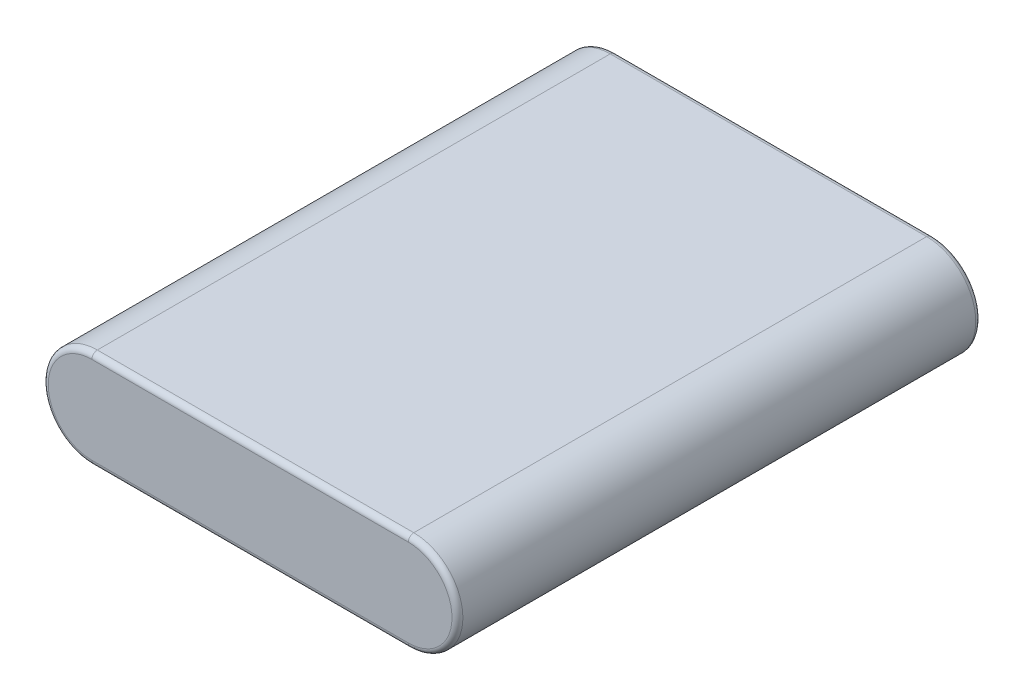
ISO-10303-21;
HEADER;
FILE_DESCRIPTION(('STEP AP214'),'2;1');
FILE_NAME('part.step','',(''),(''),'','','');
FILE_SCHEMA(('AUTOMOTIVE_DESIGN { 1 0 10303 214 1 1 1 1 }'));
ENDSEC;
DATA;
#1=APPLICATION_CONTEXT('core data for automotive mechanical design processes');
#2=APPLICATION_PROTOCOL_DEFINITION('international standard','automotive_design',2000,#1);
#3=PRODUCT_CONTEXT('',#1,'mechanical');
#4=PRODUCT('Part','Part','',(#3));
#5=PRODUCT_RELATED_PRODUCT_CATEGORY('part','',(#4));
#6=PRODUCT_DEFINITION_FORMATION('','',#4);
#7=PRODUCT_DEFINITION_CONTEXT('part definition',#1,'design');
#8=PRODUCT_DEFINITION('design','',#6,#7);
#9=PRODUCT_DEFINITION_SHAPE('','',#8);
#10=(LENGTH_UNIT() NAMED_UNIT(*) SI_UNIT(.MILLI.,.METRE.));
#11=(NAMED_UNIT(*) PLANE_ANGLE_UNIT() SI_UNIT($,.RADIAN.));
#12=(NAMED_UNIT(*) SI_UNIT($,.STERADIAN.) SOLID_ANGLE_UNIT());
#13=UNCERTAINTY_MEASURE_WITH_UNIT(LENGTH_MEASURE(1.E-05),#10,'distance_accuracy_value','');
#14=(GEOMETRIC_REPRESENTATION_CONTEXT(3) GLOBAL_UNCERTAINTY_ASSIGNED_CONTEXT((#13)) GLOBAL_UNIT_ASSIGNED_CONTEXT((#10,
#11,#12)) REPRESENTATION_CONTEXT('',''));
#15=CARTESIAN_POINT('',(0.,0.,0.));
#16=DIRECTION('',(0.,0.,1.));
#17=DIRECTION('',(1.,0.,0.));
#18=AXIS2_PLACEMENT_3D('',#15,#16,#17);
#19=CARTESIAN_POINT('',(0.,0.,96.));
#20=DIRECTION('',(0.,0.,-1.));
#21=DIRECTION('',(-1.,0.,0.));
#22=AXIS2_PLACEMENT_3D('',#19,#20,#21);
#23=CYLINDRICAL_SURFACE('',#22,8.99999999999999);
#24=DIRECTION('',(0.,0.,-1.));
#25=VECTOR('',#24,1.);
#26=CARTESIAN_POINT('',(0.,8.99999999999999,96.));
#27=LINE('',#26,#25);
#28=CARTESIAN_POINT('',(0.,8.99999999999999,95.));
#29=VERTEX_POINT('',#28);
#30=CARTESIAN_POINT('',(0.,8.99999999999999,1.));
#31=VERTEX_POINT('',#30);
#32=EDGE_CURVE('E104',#29,#31,#27,.T.);
#33=ORIENTED_EDGE('',*,*,#32,.T.);
#34=CARTESIAN_POINT('',(0.,0.,1.));
#35=DIRECTION('',(0.,0.,1.));
#36=DIRECTION('',(1.,0.,0.));
#37=AXIS2_PLACEMENT_3D('',#34,#35,#36);
#38=CIRCLE('',#37,8.99999999999999);
#39=CARTESIAN_POINT('',(0.,-8.99999999999999,1.));
#40=VERTEX_POINT('',#39);
#41=EDGE_CURVE('E183',#31,#40,#38,.T.);
#42=ORIENTED_EDGE('',*,*,#41,.T.);
#43=DIRECTION('',(0.,0.,-1.));
#44=VECTOR('',#43,1.);
#45=CARTESIAN_POINT('',(0.,-8.99999999999999,96.));
#46=LINE('',#45,#44);
#47=CARTESIAN_POINT('',(0.,-8.99999999999999,95.));
#48=VERTEX_POINT('',#47);
#49=EDGE_CURVE('E130',#48,#40,#46,.T.);
#50=ORIENTED_EDGE('',*,*,#49,.F.);
#51=CARTESIAN_POINT('',(0.,0.,95.));
#52=DIRECTION('',(0.,0.,1.));
#53=DIRECTION('',(1.,0.,0.));
#54=AXIS2_PLACEMENT_3D('',#51,#52,#53);
#55=CIRCLE('',#54,8.99999999999999);
#56=EDGE_CURVE('E181',#48,#29,#55,.F.);
#57=ORIENTED_EDGE('',*,*,#56,.T.);
#58=EDGE_LOOP('',(#33,#42,#50,#57));
#59=FACE_BOUND('',#58,.T.);
#60=ADVANCED_FACE('F33',(#59),#23,.T.);
#61=CARTESIAN_POINT('',(0.,-8.99999999999999,96.));
#62=DIRECTION('',(0.,1.,0.));
#63=DIRECTION('',(-1.,0.,0.));
#64=AXIS2_PLACEMENT_3D('',#61,#62,#63);
#65=PLANE('',#64);
#66=ORIENTED_EDGE('',*,*,#49,.T.);
#67=DIRECTION('',(1.,0.,0.));
#68=VECTOR('',#67,1.);
#69=CARTESIAN_POINT('',(0.,-8.99999999999999,1.));
#70=LINE('',#69,#68);
#71=CARTESIAN_POINT('',(58.,-9.,1.));
#72=VERTEX_POINT('',#71);
#73=EDGE_CURVE('E179',#40,#72,#70,.T.);
#74=ORIENTED_EDGE('',*,*,#73,.T.);
#75=DIRECTION('',(0.,0.,-1.));
#76=VECTOR('',#75,1.);
#77=CARTESIAN_POINT('',(58.,-9.,96.));
#78=LINE('',#77,#76);
#79=CARTESIAN_POINT('',(58.,-9.,95.));
#80=VERTEX_POINT('',#79);
#81=EDGE_CURVE('E121',#80,#72,#78,.T.);
#82=ORIENTED_EDGE('',*,*,#81,.F.);
#83=DIRECTION('',(1.,0.,0.));
#84=VECTOR('',#83,1.);
#85=CARTESIAN_POINT('',(0.,-8.99999999999999,95.));
#86=LINE('',#85,#84);
#87=EDGE_CURVE('E177',#80,#48,#86,.F.);
#88=ORIENTED_EDGE('',*,*,#87,.T.);
#89=EDGE_LOOP('',(#66,#74,#82,#88));
#90=FACE_BOUND('',#89,.T.);
#91=ADVANCED_FACE('F194',(#90),#65,.F.);
#92=CARTESIAN_POINT('',(58.,0.,96.));
#93=DIRECTION('',(0.,0.,-1.));
#94=DIRECTION('',(-1.,0.,0.));
#95=AXIS2_PLACEMENT_3D('',#92,#93,#94);
#96=CYLINDRICAL_SURFACE('',#95,9.);
#97=ORIENTED_EDGE('',*,*,#81,.T.);
#98=CARTESIAN_POINT('',(58.,0.,1.));
#99=DIRECTION('',(0.,0.,1.));
#100=DIRECTION('',(1.,0.,0.));
#101=AXIS2_PLACEMENT_3D('',#98,#99,#100);
#102=CIRCLE('',#101,9.);
#103=CARTESIAN_POINT('',(58.,9.,1.));
#104=VERTEX_POINT('',#103);
#105=EDGE_CURVE('E120',#72,#104,#102,.T.);
#106=ORIENTED_EDGE('',*,*,#105,.T.);
#107=DIRECTION('',(0.,0.,-1.));
#108=VECTOR('',#107,1.);
#109=CARTESIAN_POINT('',(58.,9.,96.));
#110=LINE('',#109,#108);
#111=CARTESIAN_POINT('',(58.,9.,95.));
#112=VERTEX_POINT('',#111);
#113=EDGE_CURVE('E102',#112,#104,#110,.T.);
#114=ORIENTED_EDGE('',*,*,#113,.F.);
#115=CARTESIAN_POINT('',(58.,0.,95.));
#116=DIRECTION('',(0.,0.,1.));
#117=DIRECTION('',(1.,0.,0.));
#118=AXIS2_PLACEMENT_3D('',#115,#116,#117);
#119=CIRCLE('',#118,9.);
#120=EDGE_CURVE('E117',#112,#80,#119,.F.);
#121=ORIENTED_EDGE('',*,*,#120,.T.);
#122=EDGE_LOOP('',(#97,#106,#114,#121));
#123=FACE_BOUND('',#122,.T.);
#124=ADVANCED_FACE('F116',(#123),#96,.T.);
#125=CARTESIAN_POINT('',(0.,8.99999999999999,96.));
#126=DIRECTION('',(0.,-1.,0.));
#127=DIRECTION('',(1.,0.,0.));
#128=AXIS2_PLACEMENT_3D('',#125,#126,#127);
#129=PLANE('',#128);
#130=ORIENTED_EDGE('',*,*,#113,.T.);
#131=DIRECTION('',(-1.,0.,0.));
#132=VECTOR('',#131,1.);
#133=CARTESIAN_POINT('',(0.,8.99999999999999,1.));
#134=LINE('',#133,#132);
#135=EDGE_CURVE('E11',#104,#31,#134,.T.);
#136=ORIENTED_EDGE('',*,*,#135,.T.);
#137=ORIENTED_EDGE('',*,*,#32,.F.);
#138=DIRECTION('',(-1.,0.,0.));
#139=VECTOR('',#138,1.);
#140=CARTESIAN_POINT('',(58.,9.,95.));
#141=LINE('',#140,#139);
#142=EDGE_CURVE('E42',#29,#112,#141,.F.);
#143=ORIENTED_EDGE('',*,*,#142,.T.);
#144=EDGE_LOOP('',(#130,#136,#137,#143));
#145=FACE_BOUND('',#144,.T.);
#146=ADVANCED_FACE('F101',(#145),#129,.F.);
#147=CARTESIAN_POINT('',(0.,0.,96.));
#148=DIRECTION('',(0.,0.,1.));
#149=DIRECTION('',(1.,0.,0.));
#150=AXIS2_PLACEMENT_3D('',#147,#148,#149);
#151=PLANE('',#150);
#152=DIRECTION('',(1.,0.,0.));
#153=VECTOR('',#152,1.);
#154=CARTESIAN_POINT('',(58.,-8.,96.));
#155=LINE('',#154,#153);
#156=CARTESIAN_POINT('',(0.,-7.99999999999999,96.));
#157=VERTEX_POINT('',#156);
#158=CARTESIAN_POINT('',(58.,-8.,96.));
#159=VERTEX_POINT('',#158);
#160=EDGE_CURVE('E50',#157,#159,#155,.T.);
#161=ORIENTED_EDGE('',*,*,#160,.T.);
#162=CARTESIAN_POINT('',(58.,0.,96.));
#163=DIRECTION('',(0.,0.,1.));
#164=DIRECTION('',(1.,0.,0.));
#165=AXIS2_PLACEMENT_3D('',#162,#163,#164);
#166=CIRCLE('',#165,8.);
#167=CARTESIAN_POINT('',(58.,8.,96.));
#168=VERTEX_POINT('',#167);
#169=EDGE_CURVE('E109',#159,#168,#166,.T.);
#170=ORIENTED_EDGE('',*,*,#169,.T.);
#171=DIRECTION('',(-1.,0.,0.));
#172=VECTOR('',#171,1.);
#173=CARTESIAN_POINT('',(0.,7.99999999999999,96.));
#174=LINE('',#173,#172);
#175=CARTESIAN_POINT('',(0.,7.99999999999999,96.));
#176=VERTEX_POINT('',#175);
#177=EDGE_CURVE('E133',#168,#176,#174,.T.);
#178=ORIENTED_EDGE('',*,*,#177,.T.);
#179=CARTESIAN_POINT('',(0.,0.,96.));
#180=DIRECTION('',(0.,0.,1.));
#181=DIRECTION('',(1.,0.,0.));
#182=AXIS2_PLACEMENT_3D('',#179,#180,#181);
#183=CIRCLE('',#182,7.99999999999999);
#184=EDGE_CURVE('E55',#176,#157,#183,.T.);
#185=ORIENTED_EDGE('',*,*,#184,.T.);
#186=EDGE_LOOP('',(#161,#170,#178,#185));
#187=FACE_BOUND('',#186,.T.);
#188=ADVANCED_FACE('F188',(#187),#151,.T.);
#189=CARTESIAN_POINT('',(0.,0.,0.));
#190=DIRECTION('',(0.,0.,1.));
#191=DIRECTION('',(1.,0.,0.));
#192=AXIS2_PLACEMENT_3D('',#189,#190,#191);
#193=PLANE('',#192);
#194=DIRECTION('',(-1.,0.,0.));
#195=VECTOR('',#194,1.);
#196=CARTESIAN_POINT('',(0.,7.99999999999999,0.));
#197=LINE('',#196,#195);
#198=CARTESIAN_POINT('',(0.,7.99999999999999,0.));
#199=VERTEX_POINT('',#198);
#200=CARTESIAN_POINT('',(58.,8.,0.));
#201=VERTEX_POINT('',#200);
#202=EDGE_CURVE('E168',#199,#201,#197,.F.);
#203=ORIENTED_EDGE('',*,*,#202,.T.);
#204=CARTESIAN_POINT('',(58.,0.,0.));
#205=DIRECTION('',(0.,0.,1.));
#206=DIRECTION('',(1.,0.,0.));
#207=AXIS2_PLACEMENT_3D('',#204,#205,#206);
#208=CIRCLE('',#207,8.);
#209=CARTESIAN_POINT('',(58.,-8.,0.));
#210=VERTEX_POINT('',#209);
#211=EDGE_CURVE('E174',#201,#210,#208,.F.);
#212=ORIENTED_EDGE('',*,*,#211,.T.);
#213=DIRECTION('',(1.,0.,0.));
#214=VECTOR('',#213,1.);
#215=CARTESIAN_POINT('',(0.,-7.99999999999999,0.));
#216=LINE('',#215,#214);
#217=CARTESIAN_POINT('',(0.,-7.99999999999999,0.));
#218=VERTEX_POINT('',#217);
#219=EDGE_CURVE('E172',#210,#218,#216,.F.);
#220=ORIENTED_EDGE('',*,*,#219,.T.);
#221=CARTESIAN_POINT('',(0.,0.,0.));
#222=DIRECTION('',(0.,0.,1.));
#223=DIRECTION('',(1.,0.,0.));
#224=AXIS2_PLACEMENT_3D('',#221,#222,#223);
#225=CIRCLE('',#224,7.99999999999999);
#226=EDGE_CURVE('E170',#218,#199,#225,.F.);
#227=ORIENTED_EDGE('',*,*,#226,.T.);
#228=EDGE_LOOP('',(#203,#212,#220,#227));
#229=FACE_BOUND('',#228,.T.);
#230=ADVANCED_FACE('F220',(#229),#193,.F.);
#231=CARTESIAN_POINT('',(0.,0.,1.));
#232=DIRECTION('',(0.,0.,1.));
#233=DIRECTION('',(1.,0.,0.));
#234=AXIS2_PLACEMENT_3D('',#231,#232,#233);
#235=TOROIDAL_SURFACE('',#234,7.99999999999999,1.);
#236=CARTESIAN_POINT('',(0.,7.99999999999999,1.));
#237=DIRECTION('',(1.,0.,0.));
#238=DIRECTION('',(0.,0.,-1.));
#239=AXIS2_PLACEMENT_3D('',#236,#237,#238);
#240=CIRCLE('',#239,1.);
#241=EDGE_CURVE('E149',#199,#31,#240,.T.);
#242=ORIENTED_EDGE('',*,*,#241,.F.);
#243=ORIENTED_EDGE('',*,*,#226,.F.);
#244=CARTESIAN_POINT('',(0.,-7.99999999999999,1.));
#245=DIRECTION('',(1.,0.,0.));
#246=DIRECTION('',(0.,0.,-1.));
#247=AXIS2_PLACEMENT_3D('',#244,#245,#246);
#248=CIRCLE('',#247,1.);
#249=EDGE_CURVE('E138',#40,#218,#248,.T.);
#250=ORIENTED_EDGE('',*,*,#249,.F.);
#251=ORIENTED_EDGE('',*,*,#41,.F.);
#252=EDGE_LOOP('',(#242,#243,#250,#251));
#253=FACE_BOUND('',#252,.T.);
#254=ADVANCED_FACE('F196',(#253),#235,.T.);
#255=CARTESIAN_POINT('',(0.,-7.99999999999999,1.));
#256=DIRECTION('',(1.,0.,0.));
#257=DIRECTION('',(0.,1.,0.));
#258=AXIS2_PLACEMENT_3D('',#255,#256,#257);
#259=CYLINDRICAL_SURFACE('',#258,1.);
#260=ORIENTED_EDGE('',*,*,#249,.T.);
#261=ORIENTED_EDGE('',*,*,#219,.F.);
#262=CARTESIAN_POINT('',(58.,-8.,1.));
#263=DIRECTION('',(1.,0.,0.));
#264=DIRECTION('',(0.,0.,-1.));
#265=AXIS2_PLACEMENT_3D('',#262,#263,#264);
#266=CIRCLE('',#265,1.);
#267=EDGE_CURVE('E143',#72,#210,#266,.T.);
#268=ORIENTED_EDGE('',*,*,#267,.F.);
#269=ORIENTED_EDGE('',*,*,#73,.F.);
#270=EDGE_LOOP('',(#260,#261,#268,#269));
#271=FACE_BOUND('',#270,.T.);
#272=ADVANCED_FACE('F199',(#271),#259,.T.);
#273=CARTESIAN_POINT('',(0.,7.99999999999999,1.));
#274=DIRECTION('',(-1.,0.,0.));
#275=DIRECTION('',(0.,-1.,0.));
#276=AXIS2_PLACEMENT_3D('',#273,#274,#275);
#277=CYLINDRICAL_SURFACE('',#276,1.);
#278=ORIENTED_EDGE('',*,*,#241,.T.);
#279=ORIENTED_EDGE('',*,*,#135,.F.);
#280=CARTESIAN_POINT('',(58.,8.,1.));
#281=DIRECTION('',(1.,0.,0.));
#282=DIRECTION('',(0.,0.,-1.));
#283=AXIS2_PLACEMENT_3D('',#280,#281,#282);
#284=CIRCLE('',#283,1.);
#285=EDGE_CURVE('E141',#201,#104,#284,.T.);
#286=ORIENTED_EDGE('',*,*,#285,.F.);
#287=ORIENTED_EDGE('',*,*,#202,.F.);
#288=EDGE_LOOP('',(#278,#279,#286,#287));
#289=FACE_BOUND('',#288,.T.);
#290=ADVANCED_FACE('F202',(#289),#277,.T.);
#291=CARTESIAN_POINT('',(58.,0.,1.));
#292=DIRECTION('',(0.,0.,1.));
#293=DIRECTION('',(1.,0.,0.));
#294=AXIS2_PLACEMENT_3D('',#291,#292,#293);
#295=TOROIDAL_SURFACE('',#294,8.,1.);
#296=ORIENTED_EDGE('',*,*,#267,.T.);
#297=ORIENTED_EDGE('',*,*,#211,.F.);
#298=ORIENTED_EDGE('',*,*,#285,.T.);
#299=ORIENTED_EDGE('',*,*,#105,.F.);
#300=EDGE_LOOP('',(#296,#297,#298,#299));
#301=FACE_BOUND('',#300,.T.);
#302=ADVANCED_FACE('F200',(#301),#295,.T.);
#303=CARTESIAN_POINT('',(0.,0.,95.));
#304=DIRECTION('',(0.,0.,1.));
#305=DIRECTION('',(1.,0.,0.));
#306=AXIS2_PLACEMENT_3D('',#303,#304,#305);
#307=TOROIDAL_SURFACE('',#306,7.99999999999999,1.);
#308=CARTESIAN_POINT('',(0.,7.99999999999999,95.));
#309=DIRECTION('',(1.,0.,0.));
#310=DIRECTION('',(0.,0.,-1.));
#311=AXIS2_PLACEMENT_3D('',#308,#309,#310);
#312=CIRCLE('',#311,1.);
#313=EDGE_CURVE('E135',#29,#176,#312,.T.);
#314=ORIENTED_EDGE('',*,*,#313,.F.);
#315=ORIENTED_EDGE('',*,*,#56,.F.);
#316=CARTESIAN_POINT('',(0.,-7.99999999999999,95.));
#317=DIRECTION('',(1.,0.,0.));
#318=DIRECTION('',(0.,1.,0.));
#319=AXIS2_PLACEMENT_3D('',#316,#317,#318);
#320=CIRCLE('',#319,1.);
#321=EDGE_CURVE('E37',#157,#48,#320,.T.);
#322=ORIENTED_EDGE('',*,*,#321,.F.);
#323=ORIENTED_EDGE('',*,*,#184,.F.);
#324=EDGE_LOOP('',(#314,#315,#322,#323));
#325=FACE_BOUND('',#324,.T.);
#326=ADVANCED_FACE('F35',(#325),#307,.T.);
#327=CARTESIAN_POINT('',(0.,-7.99999999999999,95.));
#328=DIRECTION('',(-1.,0.,0.));
#329=DIRECTION('',(0.,-1.,0.));
#330=AXIS2_PLACEMENT_3D('',#327,#328,#329);
#331=CYLINDRICAL_SURFACE('',#330,1.);
#332=ORIENTED_EDGE('',*,*,#321,.T.);
#333=ORIENTED_EDGE('',*,*,#87,.F.);
#334=CARTESIAN_POINT('',(58.,-8.,95.));
#335=DIRECTION('',(1.,0.,0.));
#336=DIRECTION('',(0.,0.,-1.));
#337=AXIS2_PLACEMENT_3D('',#334,#335,#336);
#338=CIRCLE('',#337,1.);
#339=EDGE_CURVE('E128',#159,#80,#338,.T.);
#340=ORIENTED_EDGE('',*,*,#339,.F.);
#341=ORIENTED_EDGE('',*,*,#160,.F.);
#342=EDGE_LOOP('',(#332,#333,#340,#341));
#343=FACE_BOUND('',#342,.T.);
#344=ADVANCED_FACE('F191',(#343),#331,.T.);
#345=CARTESIAN_POINT('',(0.,7.99999999999999,95.));
#346=DIRECTION('',(1.,0.,0.));
#347=DIRECTION('',(0.,1.,0.));
#348=AXIS2_PLACEMENT_3D('',#345,#346,#347);
#349=CYLINDRICAL_SURFACE('',#348,1.);
#350=ORIENTED_EDGE('',*,*,#313,.T.);
#351=ORIENTED_EDGE('',*,*,#177,.F.);
#352=CARTESIAN_POINT('',(58.,8.,95.));
#353=DIRECTION('',(1.,0.,0.));
#354=DIRECTION('',(0.,0.,-1.));
#355=AXIS2_PLACEMENT_3D('',#352,#353,#354);
#356=CIRCLE('',#355,1.);
#357=EDGE_CURVE('E126',#112,#168,#356,.T.);
#358=ORIENTED_EDGE('',*,*,#357,.F.);
#359=ORIENTED_EDGE('',*,*,#142,.F.);
#360=EDGE_LOOP('',(#350,#351,#358,#359));
#361=FACE_BOUND('',#360,.T.);
#362=ADVANCED_FACE('F132',(#361),#349,.T.);
#363=CARTESIAN_POINT('',(58.,0.,95.));
#364=DIRECTION('',(0.,0.,1.));
#365=DIRECTION('',(1.,0.,0.));
#366=AXIS2_PLACEMENT_3D('',#363,#364,#365);
#367=TOROIDAL_SURFACE('',#366,8.,1.);
#368=ORIENTED_EDGE('',*,*,#339,.T.);
#369=ORIENTED_EDGE('',*,*,#120,.F.);
#370=ORIENTED_EDGE('',*,*,#357,.T.);
#371=ORIENTED_EDGE('',*,*,#169,.F.);
#372=EDGE_LOOP('',(#368,#369,#370,#371));
#373=FACE_BOUND('',#372,.T.);
#374=ADVANCED_FACE('F124',(#373),#367,.T.);
#375=CLOSED_SHELL('',(#60,#91,#124,#146,#188,#230,#254,#272,#290,#302,#326,#344,#362,#374));
#376=MANIFOLD_SOLID_BREP('B2',#375);
#377=ADVANCED_BREP_SHAPE_REPRESENTATION('',(#18,#376),#14);
#378=SHAPE_DEFINITION_REPRESENTATION(#9,#377);
ENDSEC;
END-ISO-10303-21;
